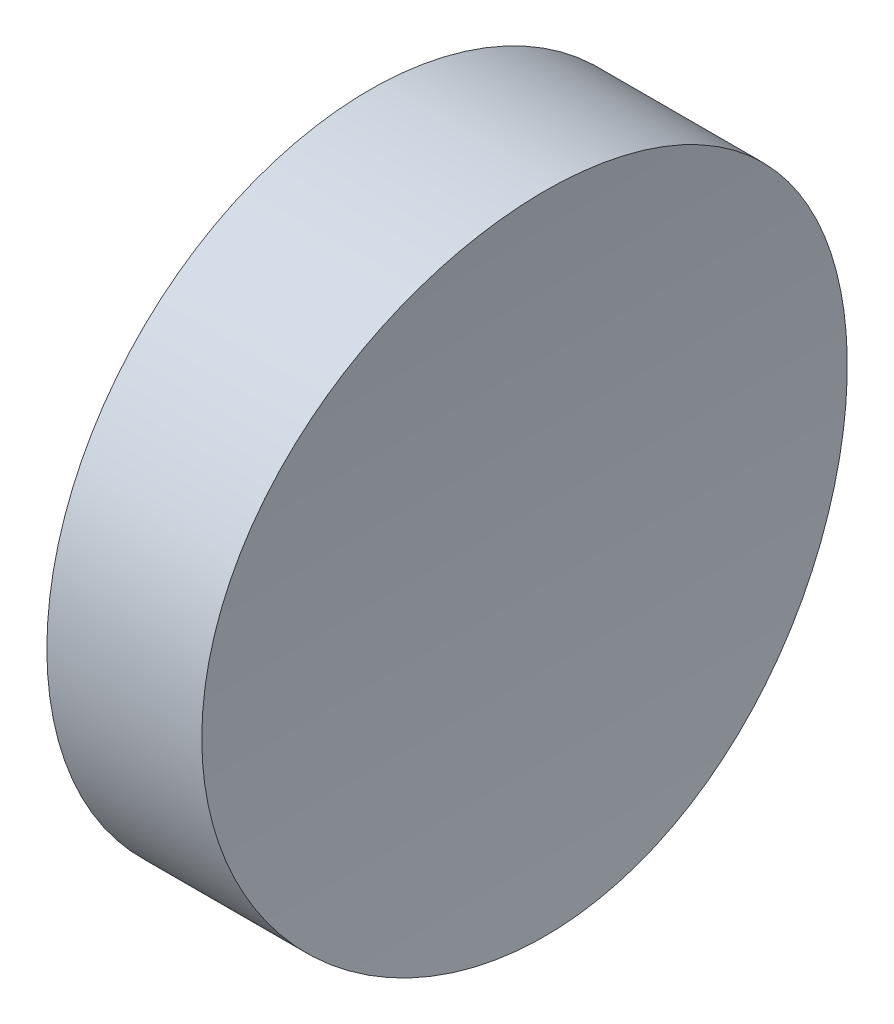
ISO-10303-21;
HEADER;
FILE_DESCRIPTION(('STEP AP214'),'2;1');
FILE_NAME('part.step','',(''),(''),'','','');
FILE_SCHEMA(('AUTOMOTIVE_DESIGN { 1 0 10303 214 1 1 1 1 }'));
ENDSEC;
DATA;
#1=APPLICATION_CONTEXT('core data for automotive mechanical design processes');
#2=APPLICATION_PROTOCOL_DEFINITION('international standard','automotive_design',2000,#1);
#3=PRODUCT_CONTEXT('',#1,'mechanical');
#4=PRODUCT('Part','Part','',(#3));
#5=PRODUCT_RELATED_PRODUCT_CATEGORY('part','',(#4));
#6=PRODUCT_DEFINITION_FORMATION('','',#4);
#7=PRODUCT_DEFINITION_CONTEXT('part definition',#1,'design');
#8=PRODUCT_DEFINITION('design','',#6,#7);
#9=PRODUCT_DEFINITION_SHAPE('','',#8);
#10=(LENGTH_UNIT() NAMED_UNIT(*) SI_UNIT(.MILLI.,.METRE.));
#11=(NAMED_UNIT(*) PLANE_ANGLE_UNIT() SI_UNIT($,.RADIAN.));
#12=(NAMED_UNIT(*) SI_UNIT($,.STERADIAN.) SOLID_ANGLE_UNIT());
#13=UNCERTAINTY_MEASURE_WITH_UNIT(LENGTH_MEASURE(1.E-05),#10,'distance_accuracy_value','');
#14=(GEOMETRIC_REPRESENTATION_CONTEXT(3) GLOBAL_UNCERTAINTY_ASSIGNED_CONTEXT((#13)) GLOBAL_UNIT_ASSIGNED_CONTEXT((#10,
#11,#12)) REPRESENTATION_CONTEXT('',''));
#15=CARTESIAN_POINT('',(0.,0.,0.));
#16=DIRECTION('',(0.,0.,1.));
#17=DIRECTION('',(1.,0.,0.));
#18=AXIS2_PLACEMENT_3D('',#15,#16,#17);
#19=CARTESIAN_POINT('',(10.,0.,0.));
#20=DIRECTION('',(-1.,0.,0.));
#21=DIRECTION('',(0.,0.,1.));
#22=AXIS2_PLACEMENT_3D('',#19,#20,#21);
#23=CYLINDRICAL_SURFACE('',#22,12.5);
#24=CARTESIAN_POINT('',(6.00000000000001,0.,12.5));
#25=CARTESIAN_POINT('',(5.99999865472065,0.349725302501323,12.5000040128596));
#26=CARTESIAN_POINT('',(6.00183822922093,0.699391688691774,12.4853178236131));
#27=CARTESIAN_POINT('',(6.00914225192195,1.39633535762782,12.4266858720543));
#28=CARTESIAN_POINT('',(6.01460752174149,1.74361208082529,12.382733477719));
#29=CARTESIAN_POINT('',(6.02901789407889,2.4334997742603,12.2658311192052));
#30=CARTESIAN_POINT('',(6.03796622505953,2.77610610966411,12.1928542507589));
#31=CARTESIAN_POINT('',(6.05908967068736,3.45389697652514,12.0184460353901));
#32=CARTESIAN_POINT('',(6.07126478404712,3.78908151094348,11.9170146998204));
#33=CARTESIAN_POINT('',(6.09848995384565,4.44943040062663,11.6865215084816));
#34=CARTESIAN_POINT('',(6.113538030762,4.77460147722778,11.5574786701742));
#35=CARTESIAN_POINT('',(6.14609297020597,5.41289046787238,11.2726550979084));
#36=CARTESIAN_POINT('',(6.16359986513855,5.7260082229948,11.1168740115584));
#37=CARTESIAN_POINT('',(6.20057943977076,6.33795030702528,10.7797217190545));
#38=CARTESIAN_POINT('',(6.22005175540154,6.63677726805936,10.5983552497968));
#39=CARTESIAN_POINT('',(6.26042169982878,7.21813259637454,10.2112932971733));
#40=CARTESIAN_POINT('',(6.28131932988708,7.50066094922602,10.0055977922688));
#41=CARTESIAN_POINT('',(6.32406256551202,8.04881727021102,9.57024778444163));
#42=CARTESIAN_POINT('',(6.34591232735472,8.31435530001055,9.34048043874408));
#43=CARTESIAN_POINT('',(6.38984835420891,8.82515837005227,8.85943909826865));
#44=CARTESIAN_POINT('',(6.41193462014528,9.0704233309819,8.60816501935968));
#45=CARTESIAN_POINT('',(6.45572221047746,9.53898032252258,8.08584874789189));
#46=CARTESIAN_POINT('',(6.47742351553188,9.76227125165178,7.81480556556114));
#47=CARTESIAN_POINT('',(6.51982661156169,10.1852986009129,7.25484794661533));
#48=CARTESIAN_POINT('',(6.54052840170874,10.3850350015242,6.96593349518988));
#49=CARTESIAN_POINT('',(6.58041221643996,10.7601710724128,6.37124242343888));
#50=CARTESIAN_POINT('',(6.5995888742378,10.9354863036889,6.0654121682941));
#51=CARTESIAN_POINT('',(6.63579383540577,11.2597139301568,5.43993817750137));
#52=CARTESIAN_POINT('',(6.65282213242278,11.4086262472709,5.12029440100801));
#53=CARTESIAN_POINT('',(6.68423831193484,11.67895586429,4.46946848669232));
#54=CARTESIAN_POINT('',(6.69862627262125,11.8003739784381,4.13828669090457));
#55=CARTESIAN_POINT('',(6.72434474588255,12.0148220292573,3.46674053554713));
#56=CARTESIAN_POINT('',(6.73567527571877,12.107852126199,3.12637622783101));
#57=CARTESIAN_POINT('',(6.7548981368445,12.2644181009037,2.44070984749545));
#58=CARTESIAN_POINT('',(6.76280813914973,12.3281056815745,2.09544290718743));
#59=CARTESIAN_POINT('',(6.77504657674618,12.4262250351781,1.40071366334128));
#60=CARTESIAN_POINT('',(6.77937502323863,12.4606568996074,1.05125137292747));
#61=CARTESIAN_POINT('',(6.78432451137795,12.5000053033855,0.350655324473399));
#62=CARTESIAN_POINT('',(6.7849456850826,12.5049228940704,-0.000478373583256443));
#63=CARTESIAN_POINT('',(6.78246289580807,12.4852084121194,-0.701901366582688));
#64=CARTESIAN_POINT('',(6.77935894427302,12.4605764302642,-1.05219066411628));
#65=CARTESIAN_POINT('',(6.76954440087264,12.382173751902,-1.74741062670371));
#66=CARTESIAN_POINT('',(6.76285453023697,12.3285704514853,-2.09236047840217));
#67=CARTESIAN_POINT('',(6.74607337562244,12.1927325098527,-2.77648959921145));
#68=CARTESIAN_POINT('',(6.73598210663567,12.1104979948325,-3.11566889374981));
#69=CARTESIAN_POINT('',(6.71268631350757,11.9180002651356,-3.78587233781069));
#70=CARTESIAN_POINT('',(6.69948174501919,11.8077366511996,-4.1168963710923));
#71=CARTESIAN_POINT('',(6.67033496952273,11.5599822787197,-4.76846867556203));
#72=CARTESIAN_POINT('',(6.65439275110156,11.4224914066665,-5.08901690307052));
#73=CARTESIAN_POINT('',(6.62017455203643,11.1208534991564,-5.71827699423328));
#74=CARTESIAN_POINT('',(6.60189225199286,10.9566339439906,-6.02695374979129));
#75=CARTESIAN_POINT('',(6.56354575213886,10.602980057961,-6.62939027551298));
#76=CARTESIAN_POINT('',(6.54348155025339,10.4135456977343,-6.92315002830504));
#77=CARTESIAN_POINT('',(6.50213531112674,10.0107885709071,-7.49373485307815));
#78=CARTESIAN_POINT('',(6.4808532269148,9.79746488264903,-7.77055927105127));
#79=CARTESIAN_POINT('',(6.43766847344772,9.34842235278796,-8.3053544500392));
#80=CARTESIAN_POINT('',(6.41576580120145,9.11270340323011,-8.56332512016019));
#81=CARTESIAN_POINT('',(6.37180015020939,8.61879746682114,-9.0603488075877));
#82=CARTESIAN_POINT('',(6.34973711117117,8.36046626355237,-9.29925853178845));
#83=CARTESIAN_POINT('',(6.3062260869434,7.8245574166724,-9.7544814808855));
#84=CARTESIAN_POINT('',(6.28477810476021,7.54697967900773,-9.97079459534432));
#85=CARTESIAN_POINT('',(6.24310313740476,6.97451605889336,-10.3792953684419));
#86=CARTESIAN_POINT('',(6.22287615849049,6.67963008774922,-10.5714829034355));
#87=CARTESIAN_POINT('',(6.18421521006037,6.07461720633715,-10.9303583191504));
#88=CARTESIAN_POINT('',(6.16578123697322,5.76449032642792,-11.0970462506623));
#89=CARTESIAN_POINT('',(6.1312223139376,5.13106882657659,-11.4037713068692));
#90=CARTESIAN_POINT('',(6.11509815900257,4.80776972184419,-11.5437992609304));
#91=CARTESIAN_POINT('',(6.08562436501185,4.15039527297815,-11.7961081923038));
#92=CARTESIAN_POINT('',(6.0722747287911,3.81631991783398,-11.9083891412647));
#93=CARTESIAN_POINT('',(6.04873061012604,3.13979202368483,-12.1043680235729));
#94=CARTESIAN_POINT('',(6.03853600701544,2.79733980559909,-12.1880670500671));
#95=CARTESIAN_POINT('',(6.02159236533473,2.1065090419015,-12.3262607294355));
#96=CARTESIAN_POINT('',(6.01484330658038,1.75813053101865,-12.3807555533901));
#97=CARTESIAN_POINT('',(6.00501662798321,1.06030607221764,-12.4598648220754));
#98=CARTESIAN_POINT('',(6.00191477550696,0.710882813975564,-12.4846765058984));
#99=CARTESIAN_POINT('',(5.99938864406445,0.0111740603037185,-12.5048939960194));
#100=CARTESIAN_POINT('',(5.99996434878698,-0.33911143129486,-12.5002999327419));
#101=CARTESIAN_POINT('',(6.00477699737811,-1.03802908018944,-12.4617409295687));
#102=CARTESIAN_POINT('',(6.00901386681588,-1.38666127095188,-12.4277765867655));
#103=CARTESIAN_POINT('',(6.02102904865161,-2.07978699929301,-12.3307317768196));
#104=CARTESIAN_POINT('',(6.02880735913648,-2.42428053910729,-12.2676513254054));
#105=CARTESIAN_POINT('',(6.04765481308326,-3.10554980386403,-12.1130988209237));
#106=CARTESIAN_POINT('',(6.05871302529447,-3.44234722454708,-12.021721033276));
#107=CARTESIAN_POINT('',(6.08382028335041,-4.10702412107202,-11.8111762367989));
#108=CARTESIAN_POINT('',(6.09786932033112,-4.43490362334108,-11.6920093103293));
#109=CARTESIAN_POINT('',(6.1285668428188,-5.07946403942911,-11.4267451539135));
#110=CARTESIAN_POINT('',(6.14521539625752,-5.39614466032855,-11.2806472201762));
#111=CARTESIAN_POINT('',(6.18064858934878,-6.01610344887656,-10.962567320307));
#112=CARTESIAN_POINT('',(6.19943324038816,-6.31938154506873,-10.7905852161937));
#113=CARTESIAN_POINT('',(6.23871827932786,-6.91196886261611,-10.4210005238731));
#114=CARTESIAN_POINT('',(6.25922701434617,-7.20119799625118,-10.2232704060324));
#115=CARTESIAN_POINT('',(6.30130146672782,-7.76199685820716,-9.80428061119183));
#116=CARTESIAN_POINT('',(6.32286718728927,-8.03356653309016,-9.58302086299614));
#117=CARTESIAN_POINT('',(6.36645252811769,-8.55717560628055,-9.11851049850081));
#118=CARTESIAN_POINT('',(6.38847216427269,-8.80921431948745,-8.87525911143376));
#119=CARTESIAN_POINT('',(6.43234743292613,-9.29200370775106,-8.3684616567294));
#120=CARTESIAN_POINT('',(6.45420306491829,-9.52275431711861,-8.10491552647276));
#121=CARTESIAN_POINT('',(6.49725876766047,-9.96261083701283,-7.55779652390902));
#122=CARTESIAN_POINT('',(6.51845438972237,-10.1715858247015,-7.27411802604857));
#123=CARTESIAN_POINT('',(6.55945423241444,-10.5648931883582,-6.69006609408307));
#124=CARTESIAN_POINT('',(6.57925844695592,-10.7492254564947,-6.38969258693224));
#125=CARTESIAN_POINT('',(6.6169077572147,-11.0919207732139,-5.77436641377528));
#126=CARTESIAN_POINT('',(6.63475288026279,-11.2502841840966,-5.45941395124356));
#127=CARTESIAN_POINT('',(6.66797028801796,-11.5398930785201,-4.81715261247421));
#128=CARTESIAN_POINT('',(6.68334258305332,-11.6711386753246,-4.48984378785248));
#129=CARTESIAN_POINT('',(6.71113276300723,-11.905238844708,-3.82607010587494));
#130=CARTESIAN_POINT('',(6.72355828961886,-12.0081669650505,-3.48963150929947));
#131=CARTESIAN_POINT('',(6.74514696010811,-12.1853239939489,-2.80917752232041));
#132=CARTESIAN_POINT('',(6.75431010760032,-12.2595529343024,-2.46516214031206));
#133=CARTESIAN_POINT('',(6.76910723962293,-12.3787533888797,-1.772037586541));
#134=CARTESIAN_POINT('',(6.77474136205338,-12.4237260463235,-1.42292861436078));
#135=CARTESIAN_POINT('',(6.78231659796997,-12.4840790461014,-0.722122778447083));
#136=CARTESIAN_POINT('',(6.78425773009963,-12.4994595378272,-0.370425927787113));
#137=CARTESIAN_POINT('',(6.78438995207575,-12.5005088092684,0.33056894052811));
#138=CARTESIAN_POINT('',(6.78260697940653,-12.4863830925103,0.679866663307639));
#139=CARTESIAN_POINT('',(6.77539483107406,-12.4289405970189,1.37601403507853));
#140=CARTESIAN_POINT('',(6.76996567341629,-12.3856239624353,1.72286369615029));
#141=CARTESIAN_POINT('',(6.75561738503052,-12.2701222179287,2.41164719263248));
#142=CARTESIAN_POINT('',(6.74669826368475,-12.1979371856138,2.75358104125576));
#143=CARTESIAN_POINT('',(6.72562587388534,-12.0252318198025,3.43011391686113));
#144=CARTESIAN_POINT('',(6.71347259900528,-11.9247114300022,3.7647129292671));
#145=CARTESIAN_POINT('',(6.68628401822868,-11.6961126097447,4.42410088586845));
#146=CARTESIAN_POINT('',(6.67124976938149,-11.5680442847112,4.74889337770578));
#147=CARTESIAN_POINT('',(6.63872330782253,-11.2852531014633,5.38652958234213));
#148=CARTESIAN_POINT('',(6.62123109727176,-11.130530266683,5.69937330564594));
#149=CARTESIAN_POINT('',(6.58428264161279,-10.7955326014385,6.31094588675353));
#150=CARTESIAN_POINT('',(6.56482638776801,-10.6152576573105,6.60967468176173));
#151=CARTESIAN_POINT('',(6.52449649144961,-10.2304260051014,7.19095837062649));
#152=CARTESIAN_POINT('',(6.50362284214985,-10.0258691800758,7.47351318657742));
#153=CARTESIAN_POINT('',(6.46089966273465,-9.59245644059898,8.02233481331263));
#154=CARTESIAN_POINT('',(6.43904454860511,-9.36344744239316,8.28848031087032));
#155=CARTESIAN_POINT('',(6.39510644518266,-8.88386988469859,8.8005632657738));
#156=CARTESIAN_POINT('',(6.3730234541133,-8.6333011570249,9.04650056544853));
#157=CARTESIAN_POINT('',(6.32924642294014,-8.11228834775017,9.51650652241918));
#158=CARTESIAN_POINT('',(6.30755247757258,-7.84183950475997,9.74056991068986));
#159=CARTESIAN_POINT('',(6.26516991470122,-7.28300581585433,10.1651843836717));
#160=CARTESIAN_POINT('',(6.24448128404028,-6.99462120478753,10.3657357761468));
#161=CARTESIAN_POINT('',(6.20461535832,-6.4007873474434,10.742628241241));
#162=CARTESIAN_POINT('',(6.18544414034938,-6.09527710565899,10.9188738747689));
#163=CARTESIAN_POINT('',(6.14924581220555,-5.47036008667539,11.2449713767958));
#164=CARTESIAN_POINT('',(6.13221870385581,-5.15095329765799,11.3948232228479));
#165=CARTESIAN_POINT('',(6.10080853872134,-4.50081318290418,11.6669070668893));
#166=CARTESIAN_POINT('',(6.08642293942963,-4.17009111606338,11.7891656502179));
#167=CARTESIAN_POINT('',(6.06068792817764,-3.49950505378495,12.0053146882452));
#168=CARTESIAN_POINT('',(6.0493378001101,-3.15964323539267,12.0992118344544));
#169=CARTESIAN_POINT('',(6.02667669280853,-2.35522086598522,12.2852262162912));
#170=CARTESIAN_POINT('',(6.01671477515627,-1.88787724261847,12.3656834800018));
#171=CARTESIAN_POINT('',(6.00337736361953,-0.946986391758156,12.4730674582918));
#172=CARTESIAN_POINT('',(6.00000182116648,-0.473439210036154,12.4999945676076));
#173=CARTESIAN_POINT('',(6.00000000000001,0.,12.5));
#174=B_SPLINE_CURVE_WITH_KNOTS('',3,(#24,#25,#26,#27,#28,#29,#30,#31,#32,#33,#34,#35,#36,#37,
#38,#39,#40,#41,#42,#43,#44,#45,#46,#47,#48,#49,#50,#51,#52,#53,#54,#55,#56,#57,#58,#59,#60,#61,
#62,#63,#64,#65,#66,#67,#68,#69,#70,#71,#72,#73,#74,#75,#76,#77,#78,#79,#80,#81,#82,#83,#84,#85,
#86,#87,#88,#89,#90,#91,#92,#93,#94,#95,#96,#97,#98,#99,#100,#101,#102,#103,#104,#105,#106,#107,
#108,#109,#110,#111,#112,#113,#114,#115,#116,#117,#118,#119,#120,#121,#122,#123,#124,#125,#126,
#127,#128,#129,#130,#131,#132,#133,#134,#135,#136,#137,#138,#139,#140,#141,#142,#143,#144,#145,
#146,#147,#148,#149,#150,#151,#152,#153,#154,#155,#156,#157,#158,#159,#160,#161,#162,#163,#164,
#165,#166,#167,#168,#169,#170,#171,#172,#173),.UNSPECIFIED.,.T.,.F.,(4,2,2,2,2,2,2,2,2,2,2,2,2,
2,2,2,2,2,2,2,2,2,2,2,2,2,2,2,2,2,2,2,2,2,2,2,2,2,2,2,2,2,2,2,2,2,2,2,2,2,2,2,2,2,2,2,2,2,2,2,2,
2,2,2,2,2,2,2,2,2,2,2,2,2,4),(0.,1.04876159455992,2.09776093020135,3.14773491168115,
4.19770847423894,5.24696118053668,6.29622771632108,7.3453002444715,8.39437370138136,
9.44860590484802,10.5028422325003,11.5571313784677,12.6114213981647,13.6692707719302,
14.7271232738796,15.7849444433466,16.8427596405552,17.8950427319001,18.9473225322459,
19.9995648488176,21.0518039327532,22.0980271875687,23.1442458310833,24.1904793782446,
25.2367172871959,26.2858426531257,27.3349692407881,28.3841363180278,29.4333084529622,
30.4897422429057,31.5461811957666,32.6026255627239,33.6590678254101,34.7158728344578,
35.7726789233194,36.8294445889462,37.8862040638933,38.9359018535449,39.985594987432,
41.0352667817453,42.0849380090248,43.131149468233,44.1773578267828,45.2235935298977,
46.2698348104111,47.3214706183476,48.373109608409,49.4247854708266,50.4764645783147,
51.5341404647313,52.5918209791685,53.6494867363023,54.7071480757663,55.762035891365,
56.8169225381841,57.8717679617203,58.9266080600129,59.9741259579594,61.0216386831254,
62.0691485922346,63.1166605828132,64.1637889673251,65.2109164312293,66.2580485532354,
67.3051857185655,68.3593125968064,69.4134476989138,70.4678360995724,71.5222106971097,
72.5806141992661,73.6390186015518,74.6963988656732,75.7535294595138,77.1732966846937,
78.5930534403343),.UNSPECIFIED.);
#175=CARTESIAN_POINT('',(6.00000000000001,0.,12.5));
#176=VERTEX_POINT('',#175);
#177=EDGE_CURVE('E10',#176,#176,#174,.T.);
#178=ORIENTED_EDGE('',*,*,#177,.T.);
#179=EDGE_LOOP('',(#178));
#180=FACE_BOUND('',#179,.T.);
#181=CARTESIAN_POINT('',(0.,0.,0.));
#182=DIRECTION('',(1.,0.,0.));
#183=DIRECTION('',(0.,0.,-1.));
#184=AXIS2_PLACEMENT_3D('',#181,#182,#183);
#185=CIRCLE('',#184,12.5);
#186=CARTESIAN_POINT('',(0.,0.,-12.5));
#187=VERTEX_POINT('',#186);
#188=EDGE_CURVE('E46',#187,#187,#185,.T.);
#189=ORIENTED_EDGE('',*,*,#188,.T.);
#190=EDGE_LOOP('',(#189));
#191=FACE_BOUND('',#190,.T.);
#192=ADVANCED_FACE('F35',(#180,#191),#23,.T.);
#193=CARTESIAN_POINT('',(0.,0.,0.));
#194=DIRECTION('',(1.,0.,0.));
#195=DIRECTION('',(0.,0.,-1.));
#196=AXIS2_PLACEMENT_3D('',#193,#194,#195);
#197=PLANE('',#196);
#198=ORIENTED_EDGE('',*,*,#188,.F.);
#199=EDGE_LOOP('',(#198));
#200=FACE_BOUND('',#199,.T.);
#201=ADVANCED_FACE('F53',(#200),#197,.F.);
#202=CARTESIAN_POINT('',(106.,0.,-12.5));
#203=DIRECTION('',(0.,0.,1.));
#204=DIRECTION('',(1.,0.,0.));
#205=AXIS2_PLACEMENT_3D('',#202,#203,#204);
#206=CYLINDRICAL_SURFACE('',#205,100.);
#207=ORIENTED_EDGE('',*,*,#177,.F.);
#208=EDGE_LOOP('',(#207));
#209=FACE_BOUND('',#208,.T.);
#210=ADVANCED_FACE('F55',(#209),#206,.F.);
#211=CLOSED_SHELL('',(#192,#201,#210));
#212=MANIFOLD_SOLID_BREP('B2',#211);
#213=ADVANCED_BREP_SHAPE_REPRESENTATION('',(#18,#212),#14);
#214=SHAPE_DEFINITION_REPRESENTATION(#9,#213);
ENDSEC;
END-ISO-10303-21;
